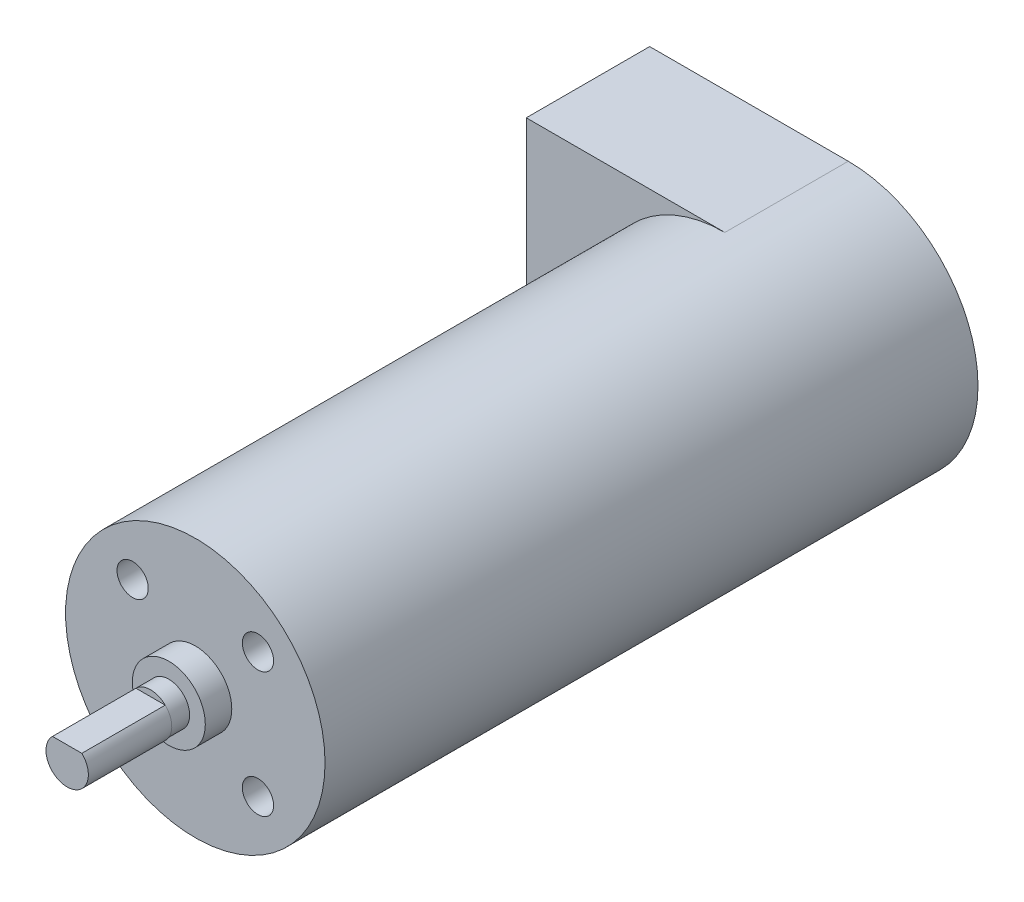
ISO-10303-21;
HEADER;
FILE_DESCRIPTION(('STEP AP214'),'2;1');
FILE_NAME('part.step','',(''),(''),'','','');
FILE_SCHEMA(('AUTOMOTIVE_DESIGN { 1 0 10303 214 1 1 1 1 }'));
ENDSEC;
DATA;
#1=APPLICATION_CONTEXT('core data for automotive mechanical design processes');
#2=APPLICATION_PROTOCOL_DEFINITION('international standard','automotive_design',2000,#1);
#3=PRODUCT_CONTEXT('',#1,'mechanical');
#4=PRODUCT('Part','Part','',(#3));
#5=PRODUCT_RELATED_PRODUCT_CATEGORY('part','',(#4));
#6=PRODUCT_DEFINITION_FORMATION('','',#4);
#7=PRODUCT_DEFINITION_CONTEXT('part definition',#1,'design');
#8=PRODUCT_DEFINITION('design','',#6,#7);
#9=PRODUCT_DEFINITION_SHAPE('','',#8);
#10=(LENGTH_UNIT() NAMED_UNIT(*) SI_UNIT(.MILLI.,.METRE.));
#11=(NAMED_UNIT(*) PLANE_ANGLE_UNIT() SI_UNIT($,.RADIAN.));
#12=(NAMED_UNIT(*) SI_UNIT($,.STERADIAN.) SOLID_ANGLE_UNIT());
#13=UNCERTAINTY_MEASURE_WITH_UNIT(LENGTH_MEASURE(1.E-05),#10,'distance_accuracy_value','');
#14=(GEOMETRIC_REPRESENTATION_CONTEXT(3) GLOBAL_UNCERTAINTY_ASSIGNED_CONTEXT((#13)) GLOBAL_UNIT_ASSIGNED_CONTEXT((#10,
#11,#12)) REPRESENTATION_CONTEXT('',''));
#15=CARTESIAN_POINT('',(0.,0.,0.));
#16=DIRECTION('',(0.,0.,1.));
#17=DIRECTION('',(1.,0.,0.));
#18=AXIS2_PLACEMENT_3D('',#15,#16,#17);
#19=CARTESIAN_POINT('',(0.,0.,27.94));
#20=DIRECTION('',(0.,0.,1.));
#21=DIRECTION('',(1.,0.,0.));
#22=AXIS2_PLACEMENT_3D('',#19,#20,#21);
#23=PLANE('',#22);
#24=CARTESIAN_POINT('',(0.,0.,27.94));
#25=DIRECTION('',(0.,0.,1.));
#26=DIRECTION('',(1.,0.,0.));
#27=AXIS2_PLACEMENT_3D('',#24,#25,#26);
#28=CIRCLE('',#27,3.5);
#29=CARTESIAN_POINT('',(3.5,0.,27.94));
#30=VERTEX_POINT('',#29);
#31=EDGE_CURVE('E132',#30,#30,#28,.T.);
#32=ORIENTED_EDGE('',*,*,#31,.T.);
#33=EDGE_LOOP('',(#32));
#34=FACE_BOUND('',#33,.T.);
#35=CARTESIAN_POINT('',(0.,0.,27.94));
#36=DIRECTION('',(0.,0.,1.));
#37=DIRECTION('',(1.,0.,0.));
#38=AXIS2_PLACEMENT_3D('',#35,#36,#37);
#39=CIRCLE('',#38,2.);
#40=CARTESIAN_POINT('',(2.,0.,27.94));
#41=VERTEX_POINT('',#40);
#42=EDGE_CURVE('E139',#41,#41,#39,.T.);
#43=ORIENTED_EDGE('',*,*,#42,.F.);
#44=EDGE_LOOP('',(#43));
#45=FACE_BOUND('',#44,.T.);
#46=ADVANCED_FACE('F35',(#34,#45),#23,.T.);
#47=CARTESIAN_POINT('',(0.,0.,25.4));
#48=DIRECTION('',(0.,0.,1.));
#49=DIRECTION('',(1.,0.,0.));
#50=AXIS2_PLACEMENT_3D('',#47,#48,#49);
#51=PLANE('',#50);
#52=CARTESIAN_POINT('',(-6.01040764008565,6.01040764008565,25.4));
#53=DIRECTION('',(0.,0.,1.));
#54=DIRECTION('',(-1.,0.,0.));
#55=AXIS2_PLACEMENT_3D('',#52,#53,#54);
#56=CIRCLE('',#55,1.5);
#57=CARTESIAN_POINT('',(-7.51040764008565,6.01040764008565,25.4));
#58=VERTEX_POINT('',#57);
#59=EDGE_CURVE('E110',#58,#58,#56,.T.);
#60=ORIENTED_EDGE('',*,*,#59,.F.);
#61=EDGE_LOOP('',(#60));
#62=FACE_BOUND('',#61,.T.);
#63=CARTESIAN_POINT('',(-6.01040764008565,-6.01040764008565,25.4));
#64=DIRECTION('',(0.,0.,1.));
#65=DIRECTION('',(1.,0.,0.));
#66=AXIS2_PLACEMENT_3D('',#63,#64,#65);
#67=CIRCLE('',#66,1.5);
#68=CARTESIAN_POINT('',(-4.51040764008565,-6.01040764008565,25.4));
#69=VERTEX_POINT('',#68);
#70=EDGE_CURVE('E172',#69,#69,#67,.T.);
#71=ORIENTED_EDGE('',*,*,#70,.F.);
#72=EDGE_LOOP('',(#71));
#73=FACE_BOUND('',#72,.T.);
#74=CARTESIAN_POINT('',(6.01040764008565,-6.01040764008565,25.4));
#75=DIRECTION('',(0.,0.,1.));
#76=DIRECTION('',(-1.,0.,0.));
#77=AXIS2_PLACEMENT_3D('',#74,#75,#76);
#78=CIRCLE('',#77,1.5);
#79=CARTESIAN_POINT('',(4.51040764008565,-6.01040764008565,25.4));
#80=VERTEX_POINT('',#79);
#81=EDGE_CURVE('E166',#80,#80,#78,.T.);
#82=ORIENTED_EDGE('',*,*,#81,.F.);
#83=EDGE_LOOP('',(#82));
#84=FACE_BOUND('',#83,.T.);
#85=CARTESIAN_POINT('',(6.01040764008565,6.01040764008565,25.4));
#86=DIRECTION('',(0.,0.,1.));
#87=DIRECTION('',(1.,0.,0.));
#88=AXIS2_PLACEMENT_3D('',#85,#86,#87);
#89=CIRCLE('',#88,1.5);
#90=CARTESIAN_POINT('',(7.51040764008565,6.01040764008565,25.4));
#91=VERTEX_POINT('',#90);
#92=EDGE_CURVE('E160',#91,#91,#89,.T.);
#93=ORIENTED_EDGE('',*,*,#92,.F.);
#94=EDGE_LOOP('',(#93));
#95=FACE_BOUND('',#94,.T.);
#96=CARTESIAN_POINT('',(0.,0.,25.4));
#97=DIRECTION('',(0.,0.,1.));
#98=DIRECTION('',(1.,0.,0.));
#99=AXIS2_PLACEMENT_3D('',#96,#97,#98);
#100=CIRCLE('',#99,12.446);
#101=CARTESIAN_POINT('',(12.446,0.,25.4));
#102=VERTEX_POINT('',#101);
#103=EDGE_CURVE('E44',#102,#102,#100,.T.);
#104=ORIENTED_EDGE('',*,*,#103,.T.);
#105=EDGE_LOOP('',(#104));
#106=FACE_BOUND('',#105,.T.);
#107=CARTESIAN_POINT('',(0.,0.,25.4));
#108=DIRECTION('',(0.,0.,1.));
#109=DIRECTION('',(1.,0.,0.));
#110=AXIS2_PLACEMENT_3D('',#107,#108,#109);
#111=CIRCLE('',#110,3.5);
#112=CARTESIAN_POINT('',(3.5,0.,25.4));
#113=VERTEX_POINT('',#112);
#114=EDGE_CURVE('E133',#113,#113,#111,.T.);
#115=ORIENTED_EDGE('',*,*,#114,.F.);
#116=EDGE_LOOP('',(#115));
#117=FACE_BOUND('',#116,.T.);
#118=ADVANCED_FACE('F200',(#62,#73,#84,#95,#106,#117),#51,.T.);
#119=CARTESIAN_POINT('',(0.,0.,-25.4));
#120=DIRECTION('',(0.,0.,1.));
#121=DIRECTION('',(1.,0.,0.));
#122=AXIS2_PLACEMENT_3D('',#119,#120,#121);
#123=CYLINDRICAL_SURFACE('',#122,12.446);
#124=CARTESIAN_POINT('',(0.,0.,-25.4));
#125=DIRECTION('',(0.,0.,1.));
#126=DIRECTION('',(1.,0.,0.));
#127=AXIS2_PLACEMENT_3D('',#124,#125,#126);
#128=CIRCLE('',#127,12.446);
#129=CARTESIAN_POINT('',(0.,12.446,-25.4));
#130=VERTEX_POINT('',#129);
#131=CARTESIAN_POINT('',(0.,-12.446,-25.4));
#132=VERTEX_POINT('',#131);
#133=EDGE_CURVE('E11',#130,#132,#128,.T.);
#134=ORIENTED_EDGE('',*,*,#133,.T.);
#135=DIRECTION('',(0.,0.,1.));
#136=VECTOR('',#135,1.);
#137=CARTESIAN_POINT('',(0.,-12.446,-37.2364));
#138=LINE('',#137,#136);
#139=CARTESIAN_POINT('',(0.,-12.446,-37.2364));
#140=VERTEX_POINT('',#139);
#141=EDGE_CURVE('E95',#140,#132,#138,.T.);
#142=ORIENTED_EDGE('',*,*,#141,.F.);
#143=CARTESIAN_POINT('',(0.,0.,-37.2364));
#144=DIRECTION('',(0.,0.,-1.));
#145=DIRECTION('',(-1.,0.,0.));
#146=AXIS2_PLACEMENT_3D('',#143,#144,#145);
#147=CIRCLE('',#146,12.446);
#148=CARTESIAN_POINT('',(0.,12.446,-37.2364));
#149=VERTEX_POINT('',#148);
#150=EDGE_CURVE('E101',#149,#140,#147,.T.);
#151=ORIENTED_EDGE('',*,*,#150,.F.);
#152=DIRECTION('',(0.,0.,1.));
#153=VECTOR('',#152,1.);
#154=CARTESIAN_POINT('',(0.,12.446,-37.2364));
#155=LINE('',#154,#153);
#156=EDGE_CURVE('E51',#149,#130,#155,.T.);
#157=ORIENTED_EDGE('',*,*,#156,.T.);
#158=EDGE_LOOP('',(#134,#142,#151,#157));
#159=FACE_BOUND('',#158,.T.);
#160=ORIENTED_EDGE('',*,*,#103,.F.);
#161=EDGE_LOOP('',(#160));
#162=FACE_BOUND('',#161,.T.);
#163=ADVANCED_FACE('F37',(#159,#162),#123,.T.);
#164=CARTESIAN_POINT('',(0.,0.,27.94));
#165=DIRECTION('',(0.,0.,-1.));
#166=DIRECTION('',(-1.,0.,0.));
#167=AXIS2_PLACEMENT_3D('',#164,#165,#166);
#168=CYLINDRICAL_SURFACE('',#167,3.5);
#169=ORIENTED_EDGE('',*,*,#31,.F.);
#170=EDGE_LOOP('',(#169));
#171=FACE_BOUND('',#170,.T.);
#172=ORIENTED_EDGE('',*,*,#114,.T.);
#173=EDGE_LOOP('',(#172));
#174=FACE_BOUND('',#173,.T.);
#175=ADVANCED_FACE('F212',(#171,#174),#168,.T.);
#176=CARTESIAN_POINT('',(0.,0.,29.69));
#177=DIRECTION('',(0.,0.,-1.));
#178=DIRECTION('',(-1.,0.,0.));
#179=AXIS2_PLACEMENT_3D('',#176,#177,#178);
#180=CYLINDRICAL_SURFACE('',#179,2.);
#181=CARTESIAN_POINT('',(0.,0.,29.69));
#182=DIRECTION('',(0.,0.,1.));
#183=DIRECTION('',(1.,0.,0.));
#184=AXIS2_PLACEMENT_3D('',#181,#182,#183);
#185=CIRCLE('',#184,2.);
#186=CARTESIAN_POINT('',(1.4056167565063,1.4227584242691,29.69));
#187=VERTEX_POINT('',#186);
#188=CARTESIAN_POINT('',(-1.4056167565063,1.4227584242691,29.69));
#189=VERTEX_POINT('',#188);
#190=EDGE_CURVE('E136',#187,#189,#185,.T.);
#191=ORIENTED_EDGE('',*,*,#190,.F.);
#192=EDGE_CURVE('E142',#189,#187,#185,.T.);
#193=ORIENTED_EDGE('',*,*,#192,.F.);
#194=EDGE_LOOP('',(#191,#193));
#195=FACE_BOUND('',#194,.T.);
#196=ORIENTED_EDGE('',*,*,#42,.T.);
#197=EDGE_LOOP('',(#196));
#198=FACE_BOUND('',#197,.T.);
#199=ADVANCED_FACE('F210',(#195,#198),#180,.T.);
#200=CARTESIAN_POINT('',(0.,0.,29.69));
#201=DIRECTION('',(0.,0.,1.));
#202=DIRECTION('',(1.,0.,0.));
#203=AXIS2_PLACEMENT_3D('',#200,#201,#202);
#204=PLANE('',#203);
#205=DIRECTION('',(-1.,0.,0.));
#206=VECTOR('',#205,1.);
#207=CARTESIAN_POINT('',(1.4056167565063,1.4227584242691,29.69));
#208=LINE('',#207,#206);
#209=EDGE_CURVE('E58',#187,#189,#208,.T.);
#210=ORIENTED_EDGE('',*,*,#209,.F.);
#211=ORIENTED_EDGE('',*,*,#190,.T.);
#212=EDGE_LOOP('',(#210,#211));
#213=FACE_BOUND('',#212,.T.);
#214=ADVANCED_FACE('F219',(#213),#204,.T.);
#215=CARTESIAN_POINT('',(0.,-0.047241575730898,29.69));
#216=DIRECTION('',(0.,0.,1.));
#217=DIRECTION('',(1.,0.,0.));
#218=AXIS2_PLACEMENT_3D('',#215,#216,#217);
#219=PLANE('',#218);
#220=CARTESIAN_POINT('',(0.,-0.047241575730898,29.69));
#221=DIRECTION('',(0.,0.,1.));
#222=DIRECTION('',(1.,0.,0.));
#223=AXIS2_PLACEMENT_3D('',#220,#221,#222);
#224=CIRCLE('',#223,2.03387769203836);
#225=EDGE_CURVE('E153',#189,#187,#224,.T.);
#226=ORIENTED_EDGE('',*,*,#225,.F.);
#227=ORIENTED_EDGE('',*,*,#192,.T.);
#228=EDGE_LOOP('',(#226,#227));
#229=FACE_BOUND('',#228,.T.);
#230=ADVANCED_FACE('F399',(#229),#219,.F.);
#231=CARTESIAN_POINT('',(0.,-0.047241575730898,37.69));
#232=DIRECTION('',(0.,0.,-1.));
#233=DIRECTION('',(-1.,0.,0.));
#234=AXIS2_PLACEMENT_3D('',#231,#232,#233);
#235=CYLINDRICAL_SURFACE('',#234,2.03387769203836);
#236=ORIENTED_EDGE('',*,*,#225,.T.);
#237=DIRECTION('',(0.,0.,-1.));
#238=VECTOR('',#237,1.);
#239=CARTESIAN_POINT('',(1.4056167565063,1.4227584242691,37.69));
#240=LINE('',#239,#238);
#241=CARTESIAN_POINT('',(1.4056167565063,1.4227584242691,37.69));
#242=VERTEX_POINT('',#241);
#243=EDGE_CURVE('E143',#242,#187,#240,.T.);
#244=ORIENTED_EDGE('',*,*,#243,.F.);
#245=CARTESIAN_POINT('',(0.,-0.047241575730898,37.69));
#246=DIRECTION('',(0.,0.,1.));
#247=DIRECTION('',(1.,0.,0.));
#248=AXIS2_PLACEMENT_3D('',#245,#246,#247);
#249=CIRCLE('',#248,2.03387769203836);
#250=CARTESIAN_POINT('',(-1.4056167565063,1.4227584242691,37.69));
#251=VERTEX_POINT('',#250);
#252=EDGE_CURVE('E152',#251,#242,#249,.T.);
#253=ORIENTED_EDGE('',*,*,#252,.F.);
#254=DIRECTION('',(0.,0.,-1.));
#255=VECTOR('',#254,1.);
#256=CARTESIAN_POINT('',(-1.4056167565063,1.4227584242691,37.69));
#257=LINE('',#256,#255);
#258=EDGE_CURVE('E147',#251,#189,#257,.T.);
#259=ORIENTED_EDGE('',*,*,#258,.T.);
#260=EDGE_LOOP('',(#236,#244,#253,#259));
#261=FACE_BOUND('',#260,.T.);
#262=ADVANCED_FACE('F389',(#261),#235,.T.);
#263=CARTESIAN_POINT('',(1.4056167565063,1.4227584242691,37.69));
#264=DIRECTION('',(0.,-1.,0.));
#265=DIRECTION('',(0.,0.,-1.));
#266=AXIS2_PLACEMENT_3D('',#263,#264,#265);
#267=PLANE('',#266);
#268=ORIENTED_EDGE('',*,*,#209,.T.);
#269=ORIENTED_EDGE('',*,*,#258,.F.);
#270=DIRECTION('',(-1.,0.,0.));
#271=VECTOR('',#270,1.);
#272=CARTESIAN_POINT('',(1.4056167565063,1.4227584242691,37.69));
#273=LINE('',#272,#271);
#274=EDGE_CURVE('E150',#242,#251,#273,.T.);
#275=ORIENTED_EDGE('',*,*,#274,.F.);
#276=ORIENTED_EDGE('',*,*,#243,.T.);
#277=EDGE_LOOP('',(#268,#269,#275,#276));
#278=FACE_BOUND('',#277,.T.);
#279=ADVANCED_FACE('F379',(#278),#267,.F.);
#280=CARTESIAN_POINT('',(0.,-0.047241575730898,37.69));
#281=DIRECTION('',(0.,0.,1.));
#282=DIRECTION('',(1.,0.,0.));
#283=AXIS2_PLACEMENT_3D('',#280,#281,#282);
#284=PLANE('',#283);
#285=ORIENTED_EDGE('',*,*,#252,.T.);
#286=ORIENTED_EDGE('',*,*,#274,.T.);
#287=EDGE_LOOP('',(#285,#286));
#288=FACE_BOUND('',#287,.T.);
#289=ADVANCED_FACE('F370',(#288),#284,.T.);
#290=CARTESIAN_POINT('',(6.01040764008565,6.01040764008565,22.225));
#291=DIRECTION('',(0.,0.,1.));
#292=DIRECTION('',(1.,0.,0.));
#293=AXIS2_PLACEMENT_3D('',#290,#291,#292);
#294=CYLINDRICAL_SURFACE('',#293,1.5);
#295=CARTESIAN_POINT('',(6.01040764008565,6.01040764008565,22.225));
#296=DIRECTION('',(0.,0.,1.));
#297=DIRECTION('',(1.,0.,0.));
#298=AXIS2_PLACEMENT_3D('',#295,#296,#297);
#299=CIRCLE('',#298,1.5);
#300=CARTESIAN_POINT('',(7.51040764008565,6.01040764008565,22.225));
#301=VERTEX_POINT('',#300);
#302=EDGE_CURVE('E156',#301,#301,#299,.T.);
#303=ORIENTED_EDGE('',*,*,#302,.F.);
#304=EDGE_LOOP('',(#303));
#305=FACE_BOUND('',#304,.T.);
#306=ORIENTED_EDGE('',*,*,#92,.T.);
#307=EDGE_LOOP('',(#306));
#308=FACE_BOUND('',#307,.T.);
#309=ADVANCED_FACE('F361',(#305,#308),#294,.F.);
#310=CARTESIAN_POINT('',(6.01040764008565,6.01040764008565,22.225));
#311=DIRECTION('',(0.,0.,1.));
#312=DIRECTION('',(1.,0.,0.));
#313=AXIS2_PLACEMENT_3D('',#310,#311,#312);
#314=PLANE('',#313);
#315=ORIENTED_EDGE('',*,*,#302,.T.);
#316=EDGE_LOOP('',(#315));
#317=FACE_BOUND('',#316,.T.);
#318=ADVANCED_FACE('F352',(#317),#314,.T.);
#319=CARTESIAN_POINT('',(6.01040764008565,-6.01040764008565,22.225));
#320=DIRECTION('',(0.,0.,1.));
#321=DIRECTION('',(1.,0.,0.));
#322=AXIS2_PLACEMENT_3D('',#319,#320,#321);
#323=CYLINDRICAL_SURFACE('',#322,1.5);
#324=CARTESIAN_POINT('',(6.01040764008565,-6.01040764008565,22.225));
#325=DIRECTION('',(0.,0.,1.));
#326=DIRECTION('',(-1.,0.,0.));
#327=AXIS2_PLACEMENT_3D('',#324,#325,#326);
#328=CIRCLE('',#327,1.5);
#329=CARTESIAN_POINT('',(4.51040764008565,-6.01040764008565,22.225));
#330=VERTEX_POINT('',#329);
#331=EDGE_CURVE('E163',#330,#330,#328,.T.);
#332=ORIENTED_EDGE('',*,*,#331,.F.);
#333=EDGE_LOOP('',(#332));
#334=FACE_BOUND('',#333,.T.);
#335=ORIENTED_EDGE('',*,*,#81,.T.);
#336=EDGE_LOOP('',(#335));
#337=FACE_BOUND('',#336,.T.);
#338=ADVANCED_FACE('F342',(#334,#337),#323,.F.);
#339=CARTESIAN_POINT('',(6.01040764008565,-6.01040764008565,22.225));
#340=DIRECTION('',(0.,0.,-1.));
#341=DIRECTION('',(-1.,0.,0.));
#342=AXIS2_PLACEMENT_3D('',#339,#340,#341);
#343=PLANE('',#342);
#344=ORIENTED_EDGE('',*,*,#331,.T.);
#345=EDGE_LOOP('',(#344));
#346=FACE_BOUND('',#345,.T.);
#347=ADVANCED_FACE('F332',(#346),#343,.F.);
#348=CARTESIAN_POINT('',(-6.01040764008565,-6.01040764008565,22.225));
#349=DIRECTION('',(0.,0.,1.));
#350=DIRECTION('',(1.,0.,0.));
#351=AXIS2_PLACEMENT_3D('',#348,#349,#350);
#352=CYLINDRICAL_SURFACE('',#351,1.5);
#353=CARTESIAN_POINT('',(-6.01040764008565,-6.01040764008565,22.225));
#354=DIRECTION('',(0.,0.,1.));
#355=DIRECTION('',(1.,0.,0.));
#356=AXIS2_PLACEMENT_3D('',#353,#354,#355);
#357=CIRCLE('',#356,1.5);
#358=CARTESIAN_POINT('',(-4.51040764008565,-6.01040764008565,22.225));
#359=VERTEX_POINT('',#358);
#360=EDGE_CURVE('E169',#359,#359,#357,.T.);
#361=ORIENTED_EDGE('',*,*,#360,.F.);
#362=EDGE_LOOP('',(#361));
#363=FACE_BOUND('',#362,.T.);
#364=ORIENTED_EDGE('',*,*,#70,.T.);
#365=EDGE_LOOP('',(#364));
#366=FACE_BOUND('',#365,.T.);
#367=ADVANCED_FACE('F322',(#363,#366),#352,.F.);
#368=CARTESIAN_POINT('',(-6.01040764008565,-6.01040764008565,22.225));
#369=DIRECTION('',(0.,0.,1.));
#370=DIRECTION('',(1.,0.,0.));
#371=AXIS2_PLACEMENT_3D('',#368,#369,#370);
#372=PLANE('',#371);
#373=ORIENTED_EDGE('',*,*,#360,.T.);
#374=EDGE_LOOP('',(#373));
#375=FACE_BOUND('',#374,.T.);
#376=ADVANCED_FACE('F313',(#375),#372,.T.);
#377=CARTESIAN_POINT('',(-6.01040764008565,6.01040764008565,22.225));
#378=DIRECTION('',(0.,0.,1.));
#379=DIRECTION('',(1.,0.,0.));
#380=AXIS2_PLACEMENT_3D('',#377,#378,#379);
#381=CYLINDRICAL_SURFACE('',#380,1.5);
#382=CARTESIAN_POINT('',(-6.01040764008565,6.01040764008565,22.225));
#383=DIRECTION('',(0.,0.,1.));
#384=DIRECTION('',(-1.,0.,0.));
#385=AXIS2_PLACEMENT_3D('',#382,#383,#384);
#386=CIRCLE('',#385,1.5);
#387=CARTESIAN_POINT('',(-7.51040764008565,6.01040764008565,22.225));
#388=VERTEX_POINT('',#387);
#389=EDGE_CURVE('E112',#388,#388,#386,.T.);
#390=ORIENTED_EDGE('',*,*,#389,.F.);
#391=EDGE_LOOP('',(#390));
#392=FACE_BOUND('',#391,.T.);
#393=ORIENTED_EDGE('',*,*,#59,.T.);
#394=EDGE_LOOP('',(#393));
#395=FACE_BOUND('',#394,.T.);
#396=ADVANCED_FACE('F239',(#392,#395),#381,.F.);
#397=CARTESIAN_POINT('',(-6.01040764008565,6.01040764008565,22.225));
#398=DIRECTION('',(0.,0.,-1.));
#399=DIRECTION('',(-1.,0.,0.));
#400=AXIS2_PLACEMENT_3D('',#397,#398,#399);
#401=PLANE('',#400);
#402=ORIENTED_EDGE('',*,*,#389,.T.);
#403=EDGE_LOOP('',(#402));
#404=FACE_BOUND('',#403,.T.);
#405=ADVANCED_FACE('F292',(#404),#401,.F.);
#406=CARTESIAN_POINT('',(-19.05,-12.446,-37.2364));
#407=DIRECTION('',(0.,1.,0.));
#408=DIRECTION('',(-1.,0.,0.));
#409=AXIS2_PLACEMENT_3D('',#406,#407,#408);
#410=PLANE('',#409);
#411=DIRECTION('',(-1.,0.,0.));
#412=VECTOR('',#411,1.);
#413=CARTESIAN_POINT('',(-19.05,-12.446,-25.4));
#414=LINE('',#413,#412);
#415=CARTESIAN_POINT('',(-19.05,-12.446,-25.4));
#416=VERTEX_POINT('',#415);
#417=EDGE_CURVE('E119',#132,#416,#414,.T.);
#418=ORIENTED_EDGE('',*,*,#417,.T.);
#419=DIRECTION('',(0.,0.,1.));
#420=VECTOR('',#419,1.);
#421=CARTESIAN_POINT('',(-19.05,-12.446,-37.2364));
#422=LINE('',#421,#420);
#423=CARTESIAN_POINT('',(-19.05,-12.446,-37.2364));
#424=VERTEX_POINT('',#423);
#425=EDGE_CURVE('E97',#424,#416,#422,.T.);
#426=ORIENTED_EDGE('',*,*,#425,.F.);
#427=DIRECTION('',(-1.,0.,0.));
#428=VECTOR('',#427,1.);
#429=CARTESIAN_POINT('',(-19.05,-12.446,-37.2364));
#430=LINE('',#429,#428);
#431=EDGE_CURVE('E91',#140,#424,#430,.T.);
#432=ORIENTED_EDGE('',*,*,#431,.F.);
#433=ORIENTED_EDGE('',*,*,#141,.T.);
#434=EDGE_LOOP('',(#418,#426,#432,#433));
#435=FACE_BOUND('',#434,.T.);
#436=ADVANCED_FACE('F93',(#435),#410,.F.);
#437=CARTESIAN_POINT('',(-19.05,12.446,-37.2364));
#438=DIRECTION('',(1.,0.,0.));
#439=DIRECTION('',(0.,1.,0.));
#440=AXIS2_PLACEMENT_3D('',#437,#438,#439);
#441=PLANE('',#440);
#442=DIRECTION('',(0.,1.,0.));
#443=VECTOR('',#442,1.);
#444=CARTESIAN_POINT('',(-19.05,12.446,-25.4));
#445=LINE('',#444,#443);
#446=CARTESIAN_POINT('',(-19.05,12.446,-25.4));
#447=VERTEX_POINT('',#446);
#448=EDGE_CURVE('E121',#416,#447,#445,.T.);
#449=ORIENTED_EDGE('',*,*,#448,.T.);
#450=DIRECTION('',(0.,0.,1.));
#451=VECTOR('',#450,1.);
#452=CARTESIAN_POINT('',(-19.05,12.446,-37.2364));
#453=LINE('',#452,#451);
#454=CARTESIAN_POINT('',(-19.05,12.446,-37.2364));
#455=VERTEX_POINT('',#454);
#456=EDGE_CURVE('E114',#455,#447,#453,.T.);
#457=ORIENTED_EDGE('',*,*,#456,.F.);
#458=DIRECTION('',(0.,1.,0.));
#459=VECTOR('',#458,1.);
#460=CARTESIAN_POINT('',(-19.05,12.446,-37.2364));
#461=LINE('',#460,#459);
#462=EDGE_CURVE('E100',#424,#455,#461,.T.);
#463=ORIENTED_EDGE('',*,*,#462,.F.);
#464=ORIENTED_EDGE('',*,*,#425,.T.);
#465=EDGE_LOOP('',(#449,#457,#463,#464));
#466=FACE_BOUND('',#465,.T.);
#467=ADVANCED_FACE('F185',(#466),#441,.F.);
#468=CARTESIAN_POINT('',(0.,12.446,-37.2364));
#469=DIRECTION('',(0.,-1.,0.));
#470=DIRECTION('',(0.,0.,-1.));
#471=AXIS2_PLACEMENT_3D('',#468,#469,#470);
#472=PLANE('',#471);
#473=DIRECTION('',(1.,0.,0.));
#474=VECTOR('',#473,1.);
#475=CARTESIAN_POINT('',(0.,12.446,-25.4));
#476=LINE('',#475,#474);
#477=EDGE_CURVE('E106',#447,#130,#476,.T.);
#478=ORIENTED_EDGE('',*,*,#477,.T.);
#479=ORIENTED_EDGE('',*,*,#156,.F.);
#480=DIRECTION('',(1.,0.,0.));
#481=VECTOR('',#480,1.);
#482=CARTESIAN_POINT('',(0.,12.446,-37.2364));
#483=LINE('',#482,#481);
#484=EDGE_CURVE('E105',#455,#149,#483,.T.);
#485=ORIENTED_EDGE('',*,*,#484,.F.);
#486=ORIENTED_EDGE('',*,*,#456,.T.);
#487=EDGE_LOOP('',(#478,#479,#485,#486));
#488=FACE_BOUND('',#487,.T.);
#489=ADVANCED_FACE('F189',(#488),#472,.F.);
#490=CARTESIAN_POINT('',(0.,0.,-37.2364));
#491=DIRECTION('',(0.,0.,-1.));
#492=DIRECTION('',(-1.,0.,0.));
#493=AXIS2_PLACEMENT_3D('',#490,#491,#492);
#494=PLANE('',#493);
#495=ORIENTED_EDGE('',*,*,#150,.T.);
#496=ORIENTED_EDGE('',*,*,#431,.T.);
#497=ORIENTED_EDGE('',*,*,#462,.T.);
#498=ORIENTED_EDGE('',*,*,#484,.T.);
#499=EDGE_LOOP('',(#495,#496,#497,#498));
#500=FACE_BOUND('',#499,.T.);
#501=ADVANCED_FACE('F103',(#500),#494,.T.);
#502=CARTESIAN_POINT('',(0.,0.,-25.4));
#503=DIRECTION('',(0.,0.,-1.));
#504=DIRECTION('',(-1.,0.,0.));
#505=AXIS2_PLACEMENT_3D('',#502,#503,#504);
#506=PLANE('',#505);
#507=ORIENTED_EDGE('',*,*,#133,.F.);
#508=ORIENTED_EDGE('',*,*,#477,.F.);
#509=ORIENTED_EDGE('',*,*,#448,.F.);
#510=ORIENTED_EDGE('',*,*,#417,.F.);
#511=EDGE_LOOP('',(#507,#508,#509,#510));
#512=FACE_BOUND('',#511,.T.);
#513=ADVANCED_FACE('F191',(#512),#506,.F.);
#514=CLOSED_SHELL('',(#46,#118,#163,#175,#199,#214,#230,#262,#279,#289,#309,#318,#338,#347,#367,
#376,#396,#405,#436,#467,#489,#501,#513));
#515=MANIFOLD_SOLID_BREP('B2',#514);
#516=ADVANCED_BREP_SHAPE_REPRESENTATION('',(#18,#515),#14);
#517=SHAPE_DEFINITION_REPRESENTATION(#9,#516);
ENDSEC;
END-ISO-10303-21;
